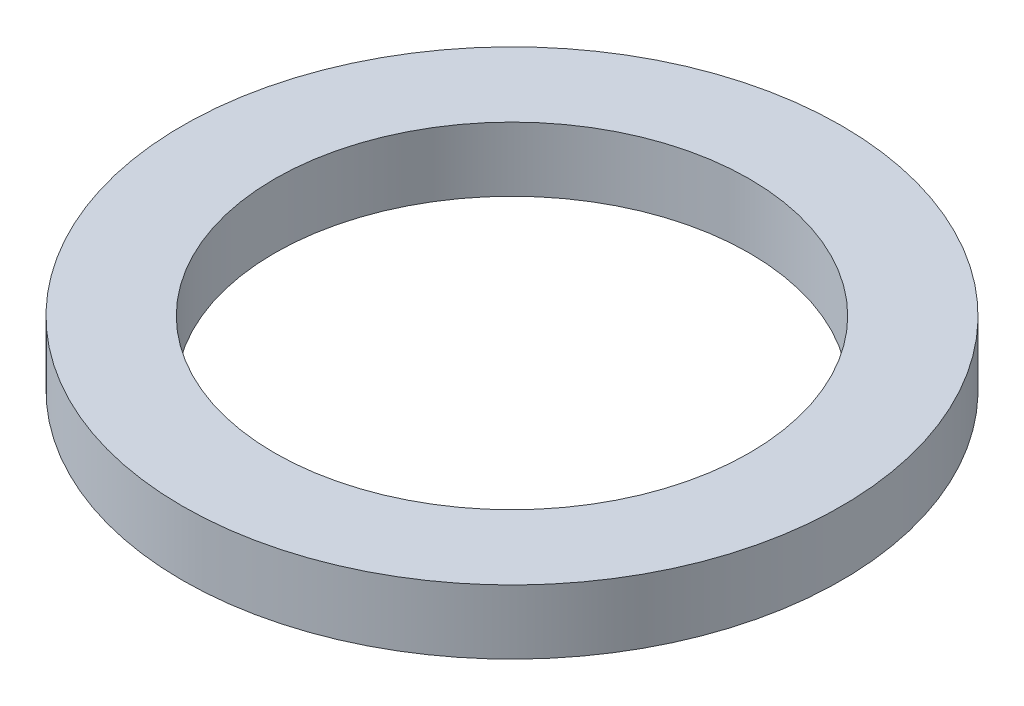
ISO-10303-21;
HEADER;
FILE_DESCRIPTION(('STEP AP214'),'2;1');
FILE_NAME('part.step','',(''),(''),'','','');
FILE_SCHEMA(('AUTOMOTIVE_DESIGN { 1 0 10303 214 1 1 1 1 }'));
ENDSEC;
DATA;
#1=APPLICATION_CONTEXT('core data for automotive mechanical design processes');
#2=APPLICATION_PROTOCOL_DEFINITION('international standard','automotive_design',2000,#1);
#3=PRODUCT_CONTEXT('',#1,'mechanical');
#4=PRODUCT('Part','Part','',(#3));
#5=PRODUCT_RELATED_PRODUCT_CATEGORY('part','',(#4));
#6=PRODUCT_DEFINITION_FORMATION('','',#4);
#7=PRODUCT_DEFINITION_CONTEXT('part definition',#1,'design');
#8=PRODUCT_DEFINITION('design','',#6,#7);
#9=PRODUCT_DEFINITION_SHAPE('','',#8);
#10=(LENGTH_UNIT() NAMED_UNIT(*) SI_UNIT(.MILLI.,.METRE.));
#11=(NAMED_UNIT(*) PLANE_ANGLE_UNIT() SI_UNIT($,.RADIAN.));
#12=(NAMED_UNIT(*) SI_UNIT($,.STERADIAN.) SOLID_ANGLE_UNIT());
#13=UNCERTAINTY_MEASURE_WITH_UNIT(LENGTH_MEASURE(1.E-05),#10,'distance_accuracy_value','');
#14=(GEOMETRIC_REPRESENTATION_CONTEXT(3) GLOBAL_UNCERTAINTY_ASSIGNED_CONTEXT((#13)) GLOBAL_UNIT_ASSIGNED_CONTEXT((#10,
#11,#12)) REPRESENTATION_CONTEXT('',''));
#15=CARTESIAN_POINT('',(0.,0.,0.));
#16=DIRECTION('',(0.,0.,1.));
#17=DIRECTION('',(1.,0.,0.));
#18=AXIS2_PLACEMENT_3D('',#15,#16,#17);
#19=CARTESIAN_POINT('',(0.,1.15,0.));
#20=DIRECTION('',(0.,1.,0.));
#21=DIRECTION('',(0.,0.,1.));
#22=AXIS2_PLACEMENT_3D('',#19,#20,#21);
#23=PLANE('',#22);
#24=CARTESIAN_POINT('',(0.,1.15,0.));
#25=DIRECTION('',(0.,1.,0.));
#26=DIRECTION('',(0.,0.,1.));
#27=AXIS2_PLACEMENT_3D('',#24,#25,#26);
#28=CIRCLE('',#27,5.9);
#29=CARTESIAN_POINT('',(0.,1.15,5.9));
#30=VERTEX_POINT('',#29);
#31=EDGE_CURVE('E10',#30,#30,#28,.T.);
#32=ORIENTED_EDGE('',*,*,#31,.T.);
#33=EDGE_LOOP('',(#32));
#34=FACE_BOUND('',#33,.T.);
#35=CARTESIAN_POINT('',(0.,1.15,0.));
#36=DIRECTION('',(0.,1.,0.));
#37=DIRECTION('',(0.,0.,1.));
#38=AXIS2_PLACEMENT_3D('',#35,#36,#37);
#39=CIRCLE('',#38,4.25);
#40=CARTESIAN_POINT('',(0.,1.15,4.25));
#41=VERTEX_POINT('',#40);
#42=EDGE_CURVE('E43',#41,#41,#39,.T.);
#43=ORIENTED_EDGE('',*,*,#42,.F.);
#44=EDGE_LOOP('',(#43));
#45=FACE_BOUND('',#44,.T.);
#46=ADVANCED_FACE('F32',(#34,#45),#23,.T.);
#47=CARTESIAN_POINT('',(0.,0.,0.));
#48=DIRECTION('',(0.,1.,0.));
#49=DIRECTION('',(0.,0.,1.));
#50=AXIS2_PLACEMENT_3D('',#47,#48,#49);
#51=PLANE('',#50);
#52=CARTESIAN_POINT('',(0.,0.,0.));
#53=DIRECTION('',(0.,1.,0.));
#54=DIRECTION('',(0.,0.,1.));
#55=AXIS2_PLACEMENT_3D('',#52,#53,#54);
#56=CIRCLE('',#55,5.9);
#57=CARTESIAN_POINT('',(0.,0.,5.9));
#58=VERTEX_POINT('',#57);
#59=EDGE_CURVE('E36',#58,#58,#56,.T.);
#60=ORIENTED_EDGE('',*,*,#59,.F.);
#61=EDGE_LOOP('',(#60));
#62=FACE_BOUND('',#61,.T.);
#63=CARTESIAN_POINT('',(0.,0.,0.));
#64=DIRECTION('',(0.,1.,0.));
#65=DIRECTION('',(0.,0.,1.));
#66=AXIS2_PLACEMENT_3D('',#63,#64,#65);
#67=CIRCLE('',#66,4.25);
#68=CARTESIAN_POINT('',(0.,0.,4.25));
#69=VERTEX_POINT('',#68);
#70=EDGE_CURVE('E45',#69,#69,#67,.T.);
#71=ORIENTED_EDGE('',*,*,#70,.T.);
#72=EDGE_LOOP('',(#71));
#73=FACE_BOUND('',#72,.T.);
#74=ADVANCED_FACE('F55',(#62,#73),#51,.F.);
#75=CARTESIAN_POINT('',(0.,1.15,0.));
#76=DIRECTION('',(0.,-1.,0.));
#77=DIRECTION('',(0.,0.,-1.));
#78=AXIS2_PLACEMENT_3D('',#75,#76,#77);
#79=CYLINDRICAL_SURFACE('',#78,5.9);
#80=ORIENTED_EDGE('',*,*,#31,.F.);
#81=EDGE_LOOP('',(#80));
#82=FACE_BOUND('',#81,.T.);
#83=ORIENTED_EDGE('',*,*,#59,.T.);
#84=EDGE_LOOP('',(#83));
#85=FACE_BOUND('',#84,.T.);
#86=ADVANCED_FACE('F34',(#82,#85),#79,.T.);
#87=CARTESIAN_POINT('',(0.,1.15,0.));
#88=DIRECTION('',(0.,-1.,0.));
#89=DIRECTION('',(0.,0.,-1.));
#90=AXIS2_PLACEMENT_3D('',#87,#88,#89);
#91=CYLINDRICAL_SURFACE('',#90,4.25);
#92=ORIENTED_EDGE('',*,*,#42,.T.);
#93=EDGE_LOOP('',(#92));
#94=FACE_BOUND('',#93,.T.);
#95=ORIENTED_EDGE('',*,*,#70,.F.);
#96=EDGE_LOOP('',(#95));
#97=FACE_BOUND('',#96,.T.);
#98=ADVANCED_FACE('F51',(#94,#97),#91,.F.);
#99=CLOSED_SHELL('',(#46,#74,#86,#98));
#100=MANIFOLD_SOLID_BREP('B2',#99);
#101=ADVANCED_BREP_SHAPE_REPRESENTATION('',(#18,#100),#14);
#102=SHAPE_DEFINITION_REPRESENTATION(#9,#101);
ENDSEC;
END-ISO-10303-21;
